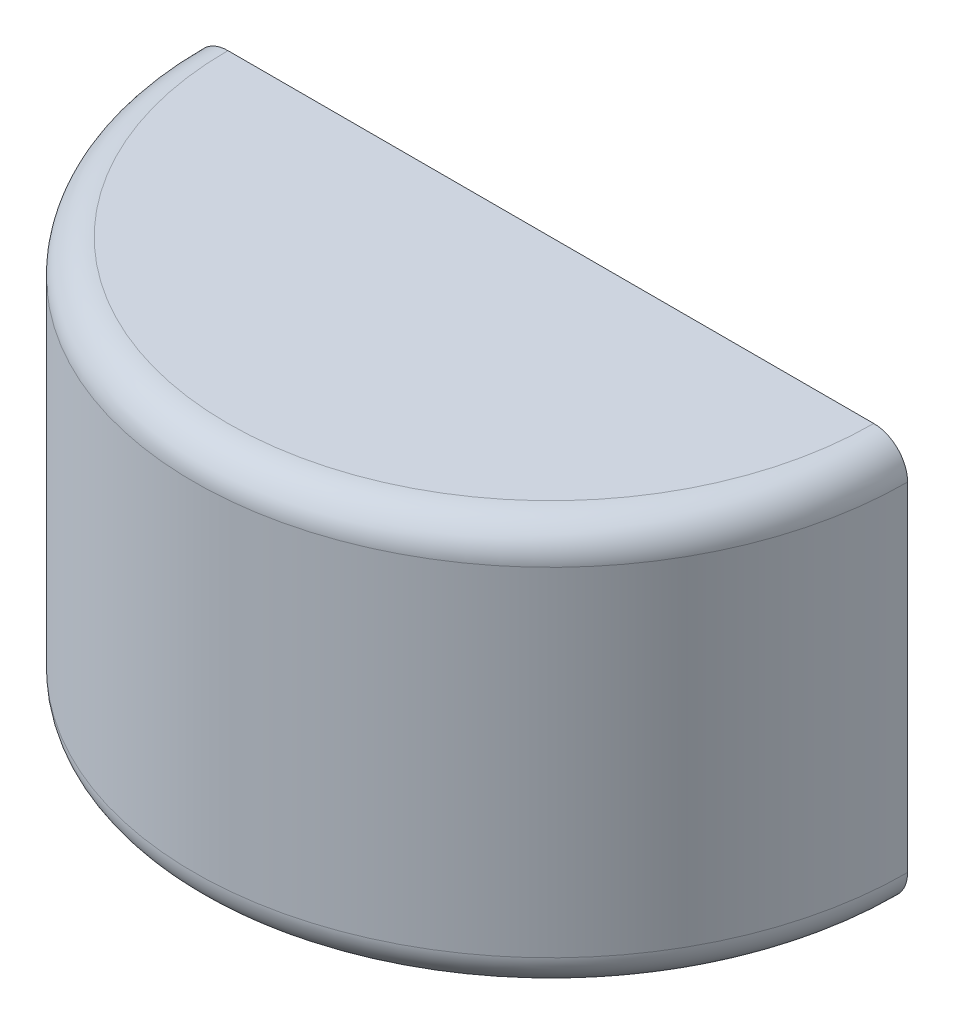
ISO-10303-21;
HEADER;
FILE_DESCRIPTION(('STEP AP214'),'2;1');
FILE_NAME('part.step','',(''),(''),'','','');
FILE_SCHEMA(('AUTOMOTIVE_DESIGN { 1 0 10303 214 1 1 1 1 }'));
ENDSEC;
DATA;
#1=APPLICATION_CONTEXT('core data for automotive mechanical design processes');
#2=APPLICATION_PROTOCOL_DEFINITION('international standard','automotive_design',2000,#1);
#3=PRODUCT_CONTEXT('',#1,'mechanical');
#4=PRODUCT('Part','Part','',(#3));
#5=PRODUCT_RELATED_PRODUCT_CATEGORY('part','',(#4));
#6=PRODUCT_DEFINITION_FORMATION('','',#4);
#7=PRODUCT_DEFINITION_CONTEXT('part definition',#1,'design');
#8=PRODUCT_DEFINITION('design','',#6,#7);
#9=PRODUCT_DEFINITION_SHAPE('','',#8);
#10=(LENGTH_UNIT() NAMED_UNIT(*) SI_UNIT(.MILLI.,.METRE.));
#11=(NAMED_UNIT(*) PLANE_ANGLE_UNIT() SI_UNIT($,.RADIAN.));
#12=(NAMED_UNIT(*) SI_UNIT($,.STERADIAN.) SOLID_ANGLE_UNIT());
#13=UNCERTAINTY_MEASURE_WITH_UNIT(LENGTH_MEASURE(1.E-05),#10,'distance_accuracy_value','');
#14=(GEOMETRIC_REPRESENTATION_CONTEXT(3) GLOBAL_UNCERTAINTY_ASSIGNED_CONTEXT((#13)) GLOBAL_UNIT_ASSIGNED_CONTEXT((#10,
#11,#12)) REPRESENTATION_CONTEXT('',''));
#15=CARTESIAN_POINT('',(0.,0.,0.));
#16=DIRECTION('',(0.,0.,1.));
#17=DIRECTION('',(1.,0.,0.));
#18=AXIS2_PLACEMENT_3D('',#15,#16,#17);
#19=CARTESIAN_POINT('',(0.,152.4,0.));
#20=DIRECTION('',(0.,-1.,0.));
#21=DIRECTION('',(0.,0.,-1.));
#22=AXIS2_PLACEMENT_3D('',#19,#20,#21);
#23=PLANE('',#22);
#24=DIRECTION('',(1.,0.,0.));
#25=VECTOR('',#24,1.);
#26=CARTESIAN_POINT('',(0.,152.4,0.));
#27=LINE('',#26,#25);
#28=CARTESIAN_POINT('',(-121.285,152.4,8.46928628363179E-13));
#29=VERTEX_POINT('',#28);
#30=CARTESIAN_POINT('',(121.285,152.4,-8.46928628363179E-13));
#31=VERTEX_POINT('',#30);
#32=EDGE_CURVE('E102',#29,#31,#27,.T.);
#33=ORIENTED_EDGE('',*,*,#32,.F.);
#34=CARTESIAN_POINT('',(0.,152.4,0.));
#35=DIRECTION('',(0.,-1.,0.));
#36=DIRECTION('',(0.,0.,-1.));
#37=AXIS2_PLACEMENT_3D('',#34,#35,#36);
#38=CIRCLE('',#37,121.285);
#39=EDGE_CURVE('E11',#29,#31,#38,.F.);
#40=ORIENTED_EDGE('',*,*,#39,.T.);
#41=EDGE_LOOP('',(#33,#40));
#42=FACE_BOUND('',#41,.T.);
#43=ADVANCED_FACE('F32',(#42),#23,.F.);
#44=CARTESIAN_POINT('',(0.,0.,0.));
#45=DIRECTION('',(0.,-1.,0.));
#46=DIRECTION('',(0.,0.,-1.));
#47=AXIS2_PLACEMENT_3D('',#44,#45,#46);
#48=CYLINDRICAL_SURFACE('',#47,133.985);
#49=DIRECTION('',(0.,-1.,0.));
#50=VECTOR('',#49,1.);
#51=CARTESIAN_POINT('',(-133.985,0.,0.));
#52=LINE('',#51,#50);
#53=CARTESIAN_POINT('',(-133.985,139.7,0.));
#54=VERTEX_POINT('',#53);
#55=CARTESIAN_POINT('',(-133.985,12.7,0.));
#56=VERTEX_POINT('',#55);
#57=EDGE_CURVE('E99',#54,#56,#52,.T.);
#58=ORIENTED_EDGE('',*,*,#57,.T.);
#59=CARTESIAN_POINT('',(0.,12.7,0.));
#60=DIRECTION('',(0.,1.,0.));
#61=DIRECTION('',(0.,0.,1.));
#62=AXIS2_PLACEMENT_3D('',#59,#60,#61);
#63=CIRCLE('',#62,133.985);
#64=CARTESIAN_POINT('',(133.985,12.7,-9.35612254369794E-13));
#65=VERTEX_POINT('',#64);
#66=EDGE_CURVE('E40',#56,#65,#63,.T.);
#67=ORIENTED_EDGE('',*,*,#66,.T.);
#68=DIRECTION('',(0.,-1.,0.));
#69=VECTOR('',#68,1.);
#70=CARTESIAN_POINT('',(133.985,0.,-9.35612254369794E-13));
#71=LINE('',#70,#69);
#72=CARTESIAN_POINT('',(133.985,139.7,-9.35612254369794E-13));
#73=VERTEX_POINT('',#72);
#74=EDGE_CURVE('E76',#73,#65,#71,.T.);
#75=ORIENTED_EDGE('',*,*,#74,.F.);
#76=CARTESIAN_POINT('',(0.,139.7,0.));
#77=DIRECTION('',(0.,-1.,0.));
#78=DIRECTION('',(0.,0.,-1.));
#79=AXIS2_PLACEMENT_3D('',#76,#77,#78);
#80=CIRCLE('',#79,133.985);
#81=EDGE_CURVE('E94',#73,#54,#80,.T.);
#82=ORIENTED_EDGE('',*,*,#81,.T.);
#83=EDGE_LOOP('',(#58,#67,#75,#82));
#84=FACE_BOUND('',#83,.T.);
#85=ADVANCED_FACE('F98',(#84),#48,.T.);
#86=CARTESIAN_POINT('',(0.,0.,0.));
#87=DIRECTION('',(0.,1.,0.));
#88=DIRECTION('',(0.,0.,1.));
#89=AXIS2_PLACEMENT_3D('',#86,#87,#88);
#90=PLANE('',#89);
#91=DIRECTION('',(-1.,0.,0.));
#92=VECTOR('',#91,1.);
#93=CARTESIAN_POINT('',(0.,0.,0.));
#94=LINE('',#93,#92);
#95=CARTESIAN_POINT('',(121.285,0.,-8.46928628363179E-13));
#96=VERTEX_POINT('',#95);
#97=CARTESIAN_POINT('',(-121.285,0.,8.46928628363179E-13));
#98=VERTEX_POINT('',#97);
#99=EDGE_CURVE('E75',#96,#98,#94,.T.);
#100=ORIENTED_EDGE('',*,*,#99,.F.);
#101=CARTESIAN_POINT('',(0.,0.,0.));
#102=DIRECTION('',(0.,1.,0.));
#103=DIRECTION('',(0.,0.,1.));
#104=AXIS2_PLACEMENT_3D('',#101,#102,#103);
#105=CIRCLE('',#104,121.285);
#106=EDGE_CURVE('E85',#96,#98,#105,.F.);
#107=ORIENTED_EDGE('',*,*,#106,.T.);
#108=EDGE_LOOP('',(#100,#107));
#109=FACE_BOUND('',#108,.T.);
#110=ADVANCED_FACE('F84',(#109),#90,.F.);
#111=CARTESIAN_POINT('',(0.,0.,0.));
#112=DIRECTION('',(0.,0.,-1.));
#113=DIRECTION('',(-1.,0.,0.));
#114=AXIS2_PLACEMENT_3D('',#111,#112,#113);
#115=PLANE('',#114);
#116=ORIENTED_EDGE('',*,*,#99,.T.);
#117=CARTESIAN_POINT('',(-121.285,12.7,8.46928628363179E-13));
#118=DIRECTION('',(0.,0.,-1.));
#119=DIRECTION('',(-1.,0.,0.));
#120=AXIS2_PLACEMENT_3D('',#117,#118,#119);
#121=CIRCLE('',#120,12.7);
#122=EDGE_CURVE('E79',#98,#56,#121,.T.);
#123=ORIENTED_EDGE('',*,*,#122,.T.);
#124=ORIENTED_EDGE('',*,*,#57,.F.);
#125=CARTESIAN_POINT('',(-121.285,139.7,8.46928628363179E-13));
#126=DIRECTION('',(0.,0.,-1.));
#127=DIRECTION('',(-1.,0.,0.));
#128=AXIS2_PLACEMENT_3D('',#125,#126,#127);
#129=CIRCLE('',#128,12.7);
#130=EDGE_CURVE('E80',#54,#29,#129,.T.);
#131=ORIENTED_EDGE('',*,*,#130,.T.);
#132=ORIENTED_EDGE('',*,*,#32,.T.);
#133=CARTESIAN_POINT('',(121.285,139.7,-8.46928628363179E-13));
#134=DIRECTION('',(0.,0.,-1.));
#135=DIRECTION('',(-1.,0.,0.));
#136=AXIS2_PLACEMENT_3D('',#133,#134,#135);
#137=CIRCLE('',#136,12.7);
#138=EDGE_CURVE('E53',#31,#73,#137,.T.);
#139=ORIENTED_EDGE('',*,*,#138,.T.);
#140=ORIENTED_EDGE('',*,*,#74,.T.);
#141=CARTESIAN_POINT('',(121.285,12.7,-8.46928628363179E-13));
#142=DIRECTION('',(0.,0.,-1.));
#143=DIRECTION('',(-1.,0.,0.));
#144=AXIS2_PLACEMENT_3D('',#141,#142,#143);
#145=CIRCLE('',#144,12.7);
#146=EDGE_CURVE('E72',#65,#96,#145,.T.);
#147=ORIENTED_EDGE('',*,*,#146,.T.);
#148=EDGE_LOOP('',(#116,#123,#124,#131,#132,#139,#140,#147));
#149=FACE_BOUND('',#148,.T.);
#150=ADVANCED_FACE('F74',(#149),#115,.T.);
#151=CARTESIAN_POINT('',(0.,12.7,0.));
#152=DIRECTION('',(0.,1.,0.));
#153=DIRECTION('',(0.,0.,1.));
#154=AXIS2_PLACEMENT_3D('',#151,#152,#153);
#155=TOROIDAL_SURFACE('',#154,121.285,12.7);
#156=ORIENTED_EDGE('',*,*,#146,.F.);
#157=ORIENTED_EDGE('',*,*,#66,.F.);
#158=ORIENTED_EDGE('',*,*,#122,.F.);
#159=ORIENTED_EDGE('',*,*,#106,.F.);
#160=EDGE_LOOP('',(#156,#157,#158,#159));
#161=FACE_BOUND('',#160,.T.);
#162=ADVANCED_FACE('F87',(#161),#155,.T.);
#163=CARTESIAN_POINT('',(0.,139.7,0.));
#164=DIRECTION('',(0.,-1.,0.));
#165=DIRECTION('',(0.,0.,-1.));
#166=AXIS2_PLACEMENT_3D('',#163,#164,#165);
#167=TOROIDAL_SURFACE('',#166,121.285,12.7);
#168=ORIENTED_EDGE('',*,*,#138,.F.);
#169=ORIENTED_EDGE('',*,*,#39,.F.);
#170=ORIENTED_EDGE('',*,*,#130,.F.);
#171=ORIENTED_EDGE('',*,*,#81,.F.);
#172=EDGE_LOOP('',(#168,#169,#170,#171));
#173=FACE_BOUND('',#172,.T.);
#174=ADVANCED_FACE('F34',(#173),#167,.T.);
#175=CLOSED_SHELL('',(#43,#85,#110,#150,#162,#174));
#176=MANIFOLD_SOLID_BREP('B2',#175);
#177=ADVANCED_BREP_SHAPE_REPRESENTATION('',(#18,#176),#14);
#178=SHAPE_DEFINITION_REPRESENTATION(#9,#177);
ENDSEC;
END-ISO-10303-21;
